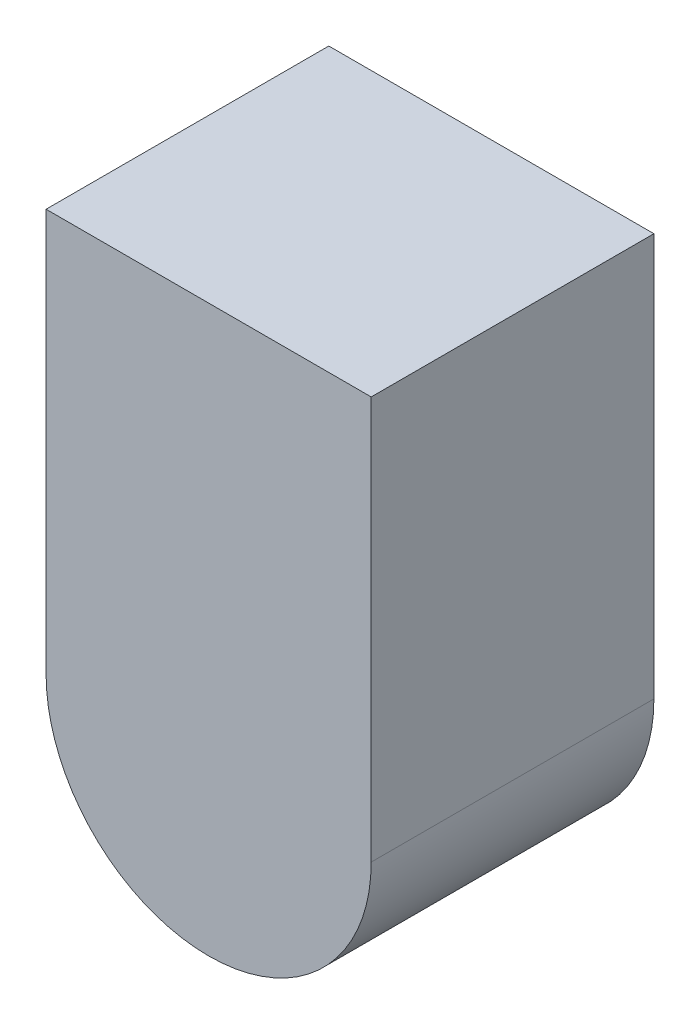
ISO-10303-21;
HEADER;
FILE_DESCRIPTION(('STEP AP214'),'2;1');
FILE_NAME('part.step','',(''),(''),'','','');
FILE_SCHEMA(('AUTOMOTIVE_DESIGN { 1 0 10303 214 1 1 1 1 }'));
ENDSEC;
DATA;
#1=APPLICATION_CONTEXT('core data for automotive mechanical design processes');
#2=APPLICATION_PROTOCOL_DEFINITION('international standard','automotive_design',2000,#1);
#3=PRODUCT_CONTEXT('',#1,'mechanical');
#4=PRODUCT('Part','Part','',(#3));
#5=PRODUCT_RELATED_PRODUCT_CATEGORY('part','',(#4));
#6=PRODUCT_DEFINITION_FORMATION('','',#4);
#7=PRODUCT_DEFINITION_CONTEXT('part definition',#1,'design');
#8=PRODUCT_DEFINITION('design','',#6,#7);
#9=PRODUCT_DEFINITION_SHAPE('','',#8);
#10=(LENGTH_UNIT() NAMED_UNIT(*) SI_UNIT(.MILLI.,.METRE.));
#11=(NAMED_UNIT(*) PLANE_ANGLE_UNIT() SI_UNIT($,.RADIAN.));
#12=(NAMED_UNIT(*) SI_UNIT($,.STERADIAN.) SOLID_ANGLE_UNIT());
#13=UNCERTAINTY_MEASURE_WITH_UNIT(LENGTH_MEASURE(1.E-05),#10,'distance_accuracy_value','');
#14=(GEOMETRIC_REPRESENTATION_CONTEXT(3) GLOBAL_UNCERTAINTY_ASSIGNED_CONTEXT((#13)) GLOBAL_UNIT_ASSIGNED_CONTEXT((#10,
#11,#12)) REPRESENTATION_CONTEXT('',''));
#15=CARTESIAN_POINT('',(0.,0.,0.));
#16=DIRECTION('',(0.,0.,1.));
#17=DIRECTION('',(1.,0.,0.));
#18=AXIS2_PLACEMENT_3D('',#15,#16,#17);
#19=CARTESIAN_POINT('',(-1.75,2.8335240809167,0.2));
#20=DIRECTION('',(0.,0.,1.));
#21=DIRECTION('',(1.,0.,0.));
#22=AXIS2_PLACEMENT_3D('',#19,#20,#21);
#23=PLANE('',#22);
#24=DIRECTION('',(0.,1.,0.));
#25=VECTOR('',#24,1.);
#26=CARTESIAN_POINT('',(-1.635,2.715,0.2));
#27=LINE('',#26,#25);
#28=CARTESIAN_POINT('',(-1.635,2.715,0.2));
#29=VERTEX_POINT('',#28);
#30=CARTESIAN_POINT('',(-1.635,3.,0.2));
#31=VERTEX_POINT('',#30);
#32=EDGE_CURVE('E11',#29,#31,#27,.T.);
#33=ORIENTED_EDGE('',*,*,#32,.T.);
#34=DIRECTION('',(-1.,0.,0.));
#35=VECTOR('',#34,1.);
#36=CARTESIAN_POINT('',(0.625,3.,0.2));
#37=LINE('',#36,#35);
#38=CARTESIAN_POINT('',(-1.865,3.,0.2));
#39=VERTEX_POINT('',#38);
#40=EDGE_CURVE('E24',#31,#39,#37,.T.);
#41=ORIENTED_EDGE('',*,*,#40,.T.);
#42=DIRECTION('',(0.,-1.,0.));
#43=VECTOR('',#42,1.);
#44=CARTESIAN_POINT('',(-1.865,3.,0.2));
#45=LINE('',#44,#43);
#46=CARTESIAN_POINT('',(-1.865,2.715,0.2));
#47=VERTEX_POINT('',#46);
#48=EDGE_CURVE('E88',#39,#47,#45,.T.);
#49=ORIENTED_EDGE('',*,*,#48,.T.);
#50=CARTESIAN_POINT('',(-1.75,2.715,0.2));
#51=DIRECTION('',(0.,0.,1.));
#52=DIRECTION('',(-1.,0.,0.));
#53=AXIS2_PLACEMENT_3D('',#50,#51,#52);
#54=CIRCLE('',#53,0.115);
#55=EDGE_CURVE('E70',#47,#29,#54,.T.);
#56=ORIENTED_EDGE('',*,*,#55,.T.);
#57=EDGE_LOOP('',(#33,#41,#49,#56));
#58=FACE_BOUND('',#57,.T.);
#59=ADVANCED_FACE('F17',(#58),#23,.T.);
#60=CARTESIAN_POINT('',(3.,3.,0.));
#61=DIRECTION('',(0.,1.,0.));
#62=DIRECTION('',(-1.,0.,0.));
#63=AXIS2_PLACEMENT_3D('',#60,#61,#62);
#64=PLANE('',#63);
#65=DIRECTION('',(0.,0.,-1.));
#66=VECTOR('',#65,1.);
#67=CARTESIAN_POINT('',(-1.865,3.,0.));
#68=LINE('',#67,#66);
#69=CARTESIAN_POINT('',(-1.865,3.,0.));
#70=VERTEX_POINT('',#69);
#71=EDGE_CURVE('E76',#39,#70,#68,.T.);
#72=ORIENTED_EDGE('',*,*,#71,.F.);
#73=ORIENTED_EDGE('',*,*,#40,.F.);
#74=DIRECTION('',(0.,0.,1.));
#75=VECTOR('',#74,1.);
#76=CARTESIAN_POINT('',(-1.635,3.,0.));
#77=LINE('',#76,#75);
#78=CARTESIAN_POINT('',(-1.635,3.,0.));
#79=VERTEX_POINT('',#78);
#80=EDGE_CURVE('E84',#79,#31,#77,.T.);
#81=ORIENTED_EDGE('',*,*,#80,.F.);
#82=DIRECTION('',(-1.,0.,0.));
#83=VECTOR('',#82,1.);
#84=CARTESIAN_POINT('',(-1.635,3.,0.));
#85=LINE('',#84,#83);
#86=EDGE_CURVE('E82',#79,#70,#85,.T.);
#87=ORIENTED_EDGE('',*,*,#86,.T.);
#88=EDGE_LOOP('',(#72,#73,#81,#87));
#89=FACE_BOUND('',#88,.T.);
#90=ADVANCED_FACE('F90',(#89),#64,.T.);
#91=CARTESIAN_POINT('',(-1.635,2.715,0.));
#92=DIRECTION('',(1.,0.,0.));
#93=DIRECTION('',(0.,1.,0.));
#94=AXIS2_PLACEMENT_3D('',#91,#92,#93);
#95=PLANE('',#94);
#96=DIRECTION('',(0.,1.,0.));
#97=VECTOR('',#96,1.);
#98=CARTESIAN_POINT('',(-1.635,2.715,0.));
#99=LINE('',#98,#97);
#100=CARTESIAN_POINT('',(-1.635,2.715,0.));
#101=VERTEX_POINT('',#100);
#102=EDGE_CURVE('E61',#101,#79,#99,.T.);
#103=ORIENTED_EDGE('',*,*,#102,.T.);
#104=ORIENTED_EDGE('',*,*,#80,.T.);
#105=ORIENTED_EDGE('',*,*,#32,.F.);
#106=DIRECTION('',(0.,0.,1.));
#107=VECTOR('',#106,1.);
#108=CARTESIAN_POINT('',(-1.635,2.715,0.));
#109=LINE('',#108,#107);
#110=EDGE_CURVE('E64',#101,#29,#109,.T.);
#111=ORIENTED_EDGE('',*,*,#110,.F.);
#112=EDGE_LOOP('',(#103,#104,#105,#111));
#113=FACE_BOUND('',#112,.T.);
#114=ADVANCED_FACE('F91',(#113),#95,.T.);
#115=CARTESIAN_POINT('',(-1.75,2.715,0.));
#116=DIRECTION('',(0.,0.,1.));
#117=DIRECTION('',(-1.,0.,0.));
#118=AXIS2_PLACEMENT_3D('',#115,#116,#117);
#119=CYLINDRICAL_SURFACE('',#118,0.115);
#120=CARTESIAN_POINT('',(-1.75,2.715,0.));
#121=DIRECTION('',(0.,0.,1.));
#122=DIRECTION('',(-1.,0.,0.));
#123=AXIS2_PLACEMENT_3D('',#120,#121,#122);
#124=CIRCLE('',#123,0.115);
#125=CARTESIAN_POINT('',(-1.865,2.715,0.));
#126=VERTEX_POINT('',#125);
#127=EDGE_CURVE('E54',#126,#101,#124,.T.);
#128=ORIENTED_EDGE('',*,*,#127,.T.);
#129=ORIENTED_EDGE('',*,*,#110,.T.);
#130=ORIENTED_EDGE('',*,*,#55,.F.);
#131=DIRECTION('',(0.,0.,1.));
#132=VECTOR('',#131,1.);
#133=CARTESIAN_POINT('',(-1.865,2.715,0.));
#134=LINE('',#133,#132);
#135=EDGE_CURVE('E65',#126,#47,#134,.T.);
#136=ORIENTED_EDGE('',*,*,#135,.F.);
#137=EDGE_LOOP('',(#128,#129,#130,#136));
#138=FACE_BOUND('',#137,.T.);
#139=ADVANCED_FACE('F69',(#138),#119,.T.);
#140=CARTESIAN_POINT('',(-1.865,3.,0.));
#141=DIRECTION('',(-1.,0.,0.));
#142=DIRECTION('',(0.,-1.,0.));
#143=AXIS2_PLACEMENT_3D('',#140,#141,#142);
#144=PLANE('',#143);
#145=DIRECTION('',(0.,-1.,0.));
#146=VECTOR('',#145,1.);
#147=CARTESIAN_POINT('',(-1.865,3.,0.));
#148=LINE('',#147,#146);
#149=EDGE_CURVE('E59',#70,#126,#148,.T.);
#150=ORIENTED_EDGE('',*,*,#149,.T.);
#151=ORIENTED_EDGE('',*,*,#135,.T.);
#152=ORIENTED_EDGE('',*,*,#48,.F.);
#153=ORIENTED_EDGE('',*,*,#71,.T.);
#154=EDGE_LOOP('',(#150,#151,#152,#153));
#155=FACE_BOUND('',#154,.T.);
#156=ADVANCED_FACE('F74',(#155),#144,.T.);
#157=CARTESIAN_POINT('',(-1.75,2.8335265642716,0.));
#158=DIRECTION('',(0.,0.,1.));
#159=DIRECTION('',(0.,-1.,0.));
#160=AXIS2_PLACEMENT_3D('',#157,#158,#159);
#161=PLANE('',#160);
#162=ORIENTED_EDGE('',*,*,#86,.F.);
#163=ORIENTED_EDGE('',*,*,#102,.F.);
#164=ORIENTED_EDGE('',*,*,#127,.F.);
#165=ORIENTED_EDGE('',*,*,#149,.F.);
#166=EDGE_LOOP('',(#162,#163,#164,#165));
#167=FACE_BOUND('',#166,.T.);
#168=ADVANCED_FACE('F57',(#167),#161,.F.);
#169=CLOSED_SHELL('',(#59,#90,#114,#139,#156,#168));
#170=MANIFOLD_SOLID_BREP('B1',#169);
#171=ADVANCED_BREP_SHAPE_REPRESENTATION('',(#18,#170),#14);
#172=SHAPE_DEFINITION_REPRESENTATION(#9,#171);
ENDSEC;
END-ISO-10303-21;
